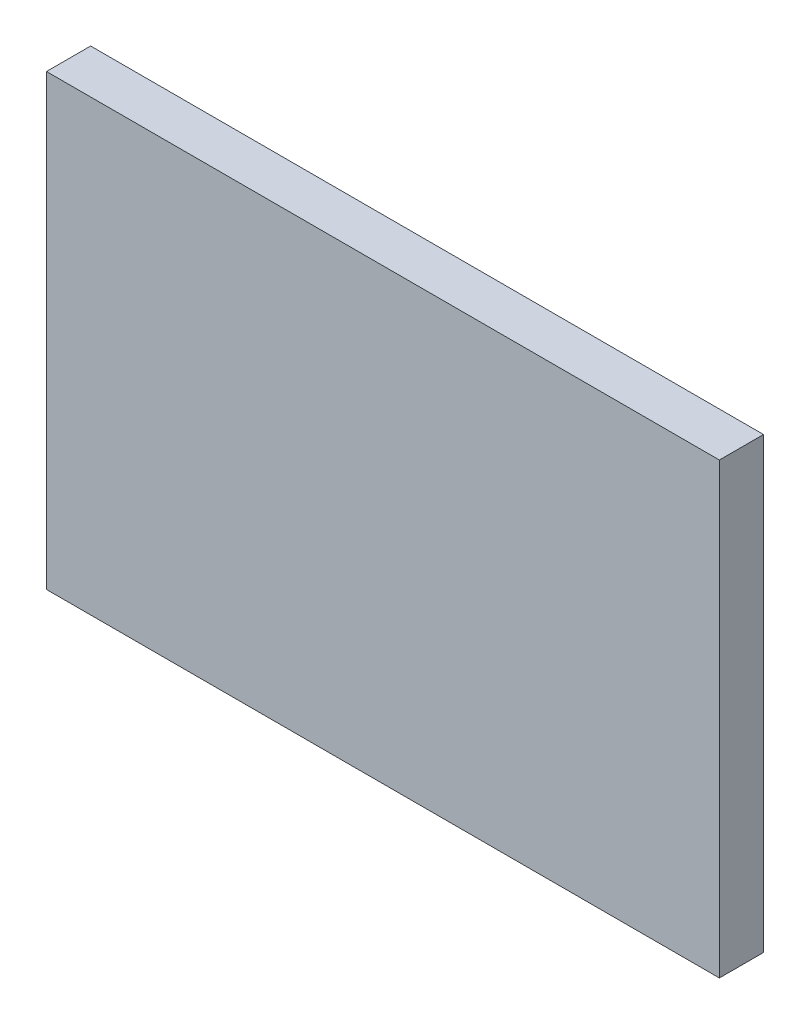
ISO-10303-21;
HEADER;
FILE_DESCRIPTION(('STEP AP214'),'2;1');
FILE_NAME('part.step','',(''),(''),'','','');
FILE_SCHEMA(('AUTOMOTIVE_DESIGN { 1 0 10303 214 1 1 1 1 }'));
ENDSEC;
DATA;
#1=APPLICATION_CONTEXT('core data for automotive mechanical design processes');
#2=APPLICATION_PROTOCOL_DEFINITION('international standard','automotive_design',2000,#1);
#3=PRODUCT_CONTEXT('',#1,'mechanical');
#4=PRODUCT('Part','Part','',(#3));
#5=PRODUCT_RELATED_PRODUCT_CATEGORY('part','',(#4));
#6=PRODUCT_DEFINITION_FORMATION('','',#4);
#7=PRODUCT_DEFINITION_CONTEXT('part definition',#1,'design');
#8=PRODUCT_DEFINITION('design','',#6,#7);
#9=PRODUCT_DEFINITION_SHAPE('','',#8);
#10=(LENGTH_UNIT() NAMED_UNIT(*) SI_UNIT(.MILLI.,.METRE.));
#11=(NAMED_UNIT(*) PLANE_ANGLE_UNIT() SI_UNIT($,.RADIAN.));
#12=(NAMED_UNIT(*) SI_UNIT($,.STERADIAN.) SOLID_ANGLE_UNIT());
#13=UNCERTAINTY_MEASURE_WITH_UNIT(LENGTH_MEASURE(1.E-05),#10,'distance_accuracy_value','');
#14=(GEOMETRIC_REPRESENTATION_CONTEXT(3) GLOBAL_UNCERTAINTY_ASSIGNED_CONTEXT((#13)) GLOBAL_UNIT_ASSIGNED_CONTEXT((#10,
#11,#12)) REPRESENTATION_CONTEXT('',''));
#15=CARTESIAN_POINT('',(0.,0.,0.));
#16=DIRECTION('',(0.,0.,1.));
#17=DIRECTION('',(1.,0.,0.));
#18=AXIS2_PLACEMENT_3D('',#15,#16,#17);
#19=CARTESIAN_POINT('',(-7.62,-5.08,1.));
#20=DIRECTION('',(1.,0.,0.));
#21=DIRECTION('',(0.,0.,-1.));
#22=AXIS2_PLACEMENT_3D('',#19,#20,#21);
#23=PLANE('',#22);
#24=DIRECTION('',(0.,-1.,0.));
#25=VECTOR('',#24,1.);
#26=CARTESIAN_POINT('',(-7.62,-5.08,0.));
#27=LINE('',#26,#25);
#28=CARTESIAN_POINT('',(-7.62,5.08,0.));
#29=VERTEX_POINT('',#28);
#30=CARTESIAN_POINT('',(-7.62,-5.08,0.));
#31=VERTEX_POINT('',#30);
#32=EDGE_CURVE('E95',#29,#31,#27,.T.);
#33=ORIENTED_EDGE('',*,*,#32,.T.);
#34=DIRECTION('',(0.,0.,-1.));
#35=VECTOR('',#34,1.);
#36=CARTESIAN_POINT('',(-7.62,-5.08,1.));
#37=LINE('',#36,#35);
#38=CARTESIAN_POINT('',(-7.62,-5.08,1.));
#39=VERTEX_POINT('',#38);
#40=EDGE_CURVE('E11',#39,#31,#37,.T.);
#41=ORIENTED_EDGE('',*,*,#40,.F.);
#42=DIRECTION('',(0.,-1.,0.));
#43=VECTOR('',#42,1.);
#44=CARTESIAN_POINT('',(-7.62,-5.08,1.));
#45=LINE('',#44,#43);
#46=CARTESIAN_POINT('',(-7.62,5.08,1.));
#47=VERTEX_POINT('',#46);
#48=EDGE_CURVE('E83',#47,#39,#45,.T.);
#49=ORIENTED_EDGE('',*,*,#48,.F.);
#50=DIRECTION('',(0.,0.,-1.));
#51=VECTOR('',#50,1.);
#52=CARTESIAN_POINT('',(-7.62,5.08,1.));
#53=LINE('',#52,#51);
#54=EDGE_CURVE('E91',#47,#29,#53,.T.);
#55=ORIENTED_EDGE('',*,*,#54,.T.);
#56=EDGE_LOOP('',(#33,#41,#49,#55));
#57=FACE_BOUND('',#56,.T.);
#58=ADVANCED_FACE('F32',(#57),#23,.F.);
#59=CARTESIAN_POINT('',(7.62,-5.08,1.));
#60=DIRECTION('',(0.,1.,0.));
#61=DIRECTION('',(0.,0.,1.));
#62=AXIS2_PLACEMENT_3D('',#59,#60,#61);
#63=PLANE('',#62);
#64=DIRECTION('',(1.,0.,0.));
#65=VECTOR('',#64,1.);
#66=CARTESIAN_POINT('',(7.62,-5.08,0.));
#67=LINE('',#66,#65);
#68=CARTESIAN_POINT('',(7.62,-5.08,0.));
#69=VERTEX_POINT('',#68);
#70=EDGE_CURVE('E87',#31,#69,#67,.T.);
#71=ORIENTED_EDGE('',*,*,#70,.T.);
#72=DIRECTION('',(0.,0.,-1.));
#73=VECTOR('',#72,1.);
#74=CARTESIAN_POINT('',(7.62,-5.08,1.));
#75=LINE('',#74,#73);
#76=CARTESIAN_POINT('',(7.62,-5.08,1.));
#77=VERTEX_POINT('',#76);
#78=EDGE_CURVE('E40',#77,#69,#75,.T.);
#79=ORIENTED_EDGE('',*,*,#78,.F.);
#80=DIRECTION('',(1.,0.,0.));
#81=VECTOR('',#80,1.);
#82=CARTESIAN_POINT('',(7.62,-5.08,1.));
#83=LINE('',#82,#81);
#84=EDGE_CURVE('E78',#39,#77,#83,.T.);
#85=ORIENTED_EDGE('',*,*,#84,.F.);
#86=ORIENTED_EDGE('',*,*,#40,.T.);
#87=EDGE_LOOP('',(#71,#79,#85,#86));
#88=FACE_BOUND('',#87,.T.);
#89=ADVANCED_FACE('F86',(#88),#63,.F.);
#90=CARTESIAN_POINT('',(7.62,5.08,1.));
#91=DIRECTION('',(-1.,0.,0.));
#92=DIRECTION('',(0.,0.,1.));
#93=AXIS2_PLACEMENT_3D('',#90,#91,#92);
#94=PLANE('',#93);
#95=DIRECTION('',(0.,1.,0.));
#96=VECTOR('',#95,1.);
#97=CARTESIAN_POINT('',(7.62,5.08,0.));
#98=LINE('',#97,#96);
#99=CARTESIAN_POINT('',(7.62,5.08,0.));
#100=VERTEX_POINT('',#99);
#101=EDGE_CURVE('E65',#69,#100,#98,.T.);
#102=ORIENTED_EDGE('',*,*,#101,.T.);
#103=DIRECTION('',(0.,0.,-1.));
#104=VECTOR('',#103,1.);
#105=CARTESIAN_POINT('',(7.62,5.08,1.));
#106=LINE('',#105,#104);
#107=CARTESIAN_POINT('',(7.62,5.08,1.));
#108=VERTEX_POINT('',#107);
#109=EDGE_CURVE('E88',#108,#100,#106,.T.);
#110=ORIENTED_EDGE('',*,*,#109,.F.);
#111=DIRECTION('',(0.,1.,0.));
#112=VECTOR('',#111,1.);
#113=CARTESIAN_POINT('',(7.62,5.08,1.));
#114=LINE('',#113,#112);
#115=EDGE_CURVE('E81',#77,#108,#114,.T.);
#116=ORIENTED_EDGE('',*,*,#115,.F.);
#117=ORIENTED_EDGE('',*,*,#78,.T.);
#118=EDGE_LOOP('',(#102,#110,#116,#117));
#119=FACE_BOUND('',#118,.T.);
#120=ADVANCED_FACE('F89',(#119),#94,.F.);
#121=CARTESIAN_POINT('',(-7.62,5.08,1.));
#122=DIRECTION('',(0.,-1.,0.));
#123=DIRECTION('',(0.,0.,-1.));
#124=AXIS2_PLACEMENT_3D('',#121,#122,#123);
#125=PLANE('',#124);
#126=DIRECTION('',(-1.,0.,0.));
#127=VECTOR('',#126,1.);
#128=CARTESIAN_POINT('',(-7.62,5.08,0.));
#129=LINE('',#128,#127);
#130=EDGE_CURVE('E71',#100,#29,#129,.T.);
#131=ORIENTED_EDGE('',*,*,#130,.T.);
#132=ORIENTED_EDGE('',*,*,#54,.F.);
#133=DIRECTION('',(-1.,0.,0.));
#134=VECTOR('',#133,1.);
#135=CARTESIAN_POINT('',(-7.62,5.08,1.));
#136=LINE('',#135,#134);
#137=EDGE_CURVE('E48',#108,#47,#136,.T.);
#138=ORIENTED_EDGE('',*,*,#137,.F.);
#139=ORIENTED_EDGE('',*,*,#109,.T.);
#140=EDGE_LOOP('',(#131,#132,#138,#139));
#141=FACE_BOUND('',#140,.T.);
#142=ADVANCED_FACE('F102',(#141),#125,.F.);
#143=CARTESIAN_POINT('',(0.,0.,1.));
#144=DIRECTION('',(0.,0.,-1.));
#145=DIRECTION('',(-1.,0.,0.));
#146=AXIS2_PLACEMENT_3D('',#143,#144,#145);
#147=PLANE('',#146);
#148=ORIENTED_EDGE('',*,*,#48,.T.);
#149=ORIENTED_EDGE('',*,*,#84,.T.);
#150=ORIENTED_EDGE('',*,*,#115,.T.);
#151=ORIENTED_EDGE('',*,*,#137,.T.);
#152=EDGE_LOOP('',(#148,#149,#150,#151));
#153=FACE_BOUND('',#152,.T.);
#154=ADVANCED_FACE('F79',(#153),#147,.F.);
#155=CARTESIAN_POINT('',(0.,0.,0.));
#156=DIRECTION('',(0.,0.,-1.));
#157=DIRECTION('',(-1.,0.,0.));
#158=AXIS2_PLACEMENT_3D('',#155,#156,#157);
#159=PLANE('',#158);
#160=ORIENTED_EDGE('',*,*,#32,.F.);
#161=ORIENTED_EDGE('',*,*,#130,.F.);
#162=ORIENTED_EDGE('',*,*,#101,.F.);
#163=ORIENTED_EDGE('',*,*,#70,.F.);
#164=EDGE_LOOP('',(#160,#161,#162,#163));
#165=FACE_BOUND('',#164,.T.);
#166=ADVANCED_FACE('F105',(#165),#159,.T.);
#167=CLOSED_SHELL('',(#58,#89,#120,#142,#154,#166));
#168=MANIFOLD_SOLID_BREP('B2',#167);
#169=ADVANCED_BREP_SHAPE_REPRESENTATION('',(#18,#168),#14);
#170=SHAPE_DEFINITION_REPRESENTATION(#9,#169);
ENDSEC;
END-ISO-10303-21;
